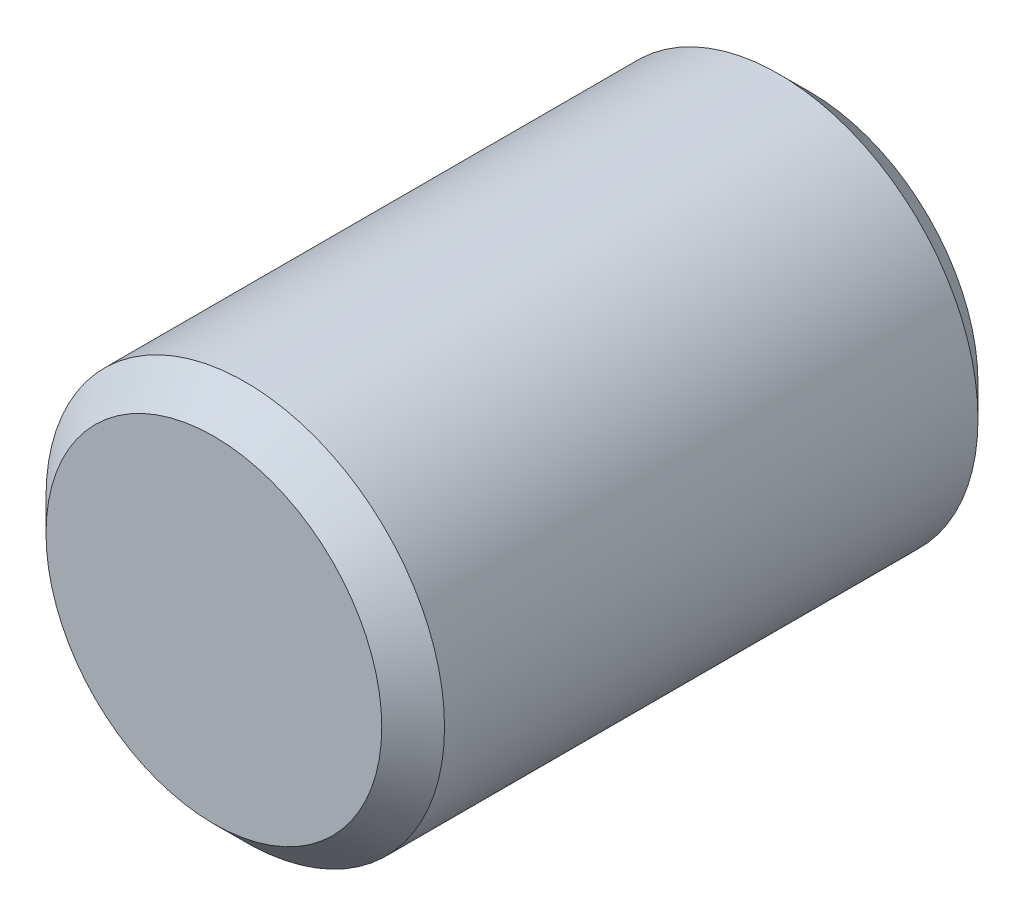
ISO-10303-21;
HEADER;
FILE_DESCRIPTION(('STEP AP214'),'2;1');
FILE_NAME('part.step','',(''),(''),'','','');
FILE_SCHEMA(('AUTOMOTIVE_DESIGN { 1 0 10303 214 1 1 1 1 }'));
ENDSEC;
DATA;
#1=APPLICATION_CONTEXT('core data for automotive mechanical design processes');
#2=APPLICATION_PROTOCOL_DEFINITION('international standard','automotive_design',2000,#1);
#3=PRODUCT_CONTEXT('',#1,'mechanical');
#4=PRODUCT('Part','Part','',(#3));
#5=PRODUCT_RELATED_PRODUCT_CATEGORY('part','',(#4));
#6=PRODUCT_DEFINITION_FORMATION('','',#4);
#7=PRODUCT_DEFINITION_CONTEXT('part definition',#1,'design');
#8=PRODUCT_DEFINITION('design','',#6,#7);
#9=PRODUCT_DEFINITION_SHAPE('','',#8);
#10=(LENGTH_UNIT() NAMED_UNIT(*) SI_UNIT(.MILLI.,.METRE.));
#11=(NAMED_UNIT(*) PLANE_ANGLE_UNIT() SI_UNIT($,.RADIAN.));
#12=(NAMED_UNIT(*) SI_UNIT($,.STERADIAN.) SOLID_ANGLE_UNIT());
#13=UNCERTAINTY_MEASURE_WITH_UNIT(LENGTH_MEASURE(1.E-05),#10,'distance_accuracy_value','');
#14=(GEOMETRIC_REPRESENTATION_CONTEXT(3) GLOBAL_UNCERTAINTY_ASSIGNED_CONTEXT((#13)) GLOBAL_UNIT_ASSIGNED_CONTEXT((#10,
#11,#12)) REPRESENTATION_CONTEXT('',''));
#15=CARTESIAN_POINT('',(0.,0.,0.));
#16=DIRECTION('',(0.,0.,1.));
#17=DIRECTION('',(1.,0.,0.));
#18=AXIS2_PLACEMENT_3D('',#15,#16,#17);
#19=CARTESIAN_POINT('',(0.,0.,-4.75));
#20=DIRECTION('',(0.,0.,1.));
#21=DIRECTION('',(1.,0.,0.));
#22=AXIS2_PLACEMENT_3D('',#19,#20,#21);
#23=CYLINDRICAL_SURFACE('',#22,3.175);
#24=CARTESIAN_POINT('',(0.,0.,-4.25));
#25=DIRECTION('',(0.,0.,1.));
#26=DIRECTION('',(1.,0.,0.));
#27=AXIS2_PLACEMENT_3D('',#24,#25,#26);
#28=CIRCLE('',#27,3.175);
#29=CARTESIAN_POINT('',(3.175,0.,-4.25));
#30=VERTEX_POINT('',#29);
#31=EDGE_CURVE('E41',#30,#30,#28,.T.);
#32=ORIENTED_EDGE('',*,*,#31,.T.);
#33=EDGE_LOOP('',(#32));
#34=FACE_BOUND('',#33,.T.);
#35=CARTESIAN_POINT('',(0.,0.,4.25));
#36=DIRECTION('',(0.,0.,1.));
#37=DIRECTION('',(1.,0.,0.));
#38=AXIS2_PLACEMENT_3D('',#35,#36,#37);
#39=CIRCLE('',#38,3.175);
#40=CARTESIAN_POINT('',(3.175,0.,4.25));
#41=VERTEX_POINT('',#40);
#42=EDGE_CURVE('E45',#41,#41,#39,.F.);
#43=ORIENTED_EDGE('',*,*,#42,.T.);
#44=EDGE_LOOP('',(#43));
#45=FACE_BOUND('',#44,.T.);
#46=ADVANCED_FACE('F30',(#34,#45),#23,.T.);
#47=CARTESIAN_POINT('',(0.,0.,-4.75));
#48=DIRECTION('',(0.,0.,1.));
#49=DIRECTION('',(1.,0.,0.));
#50=AXIS2_PLACEMENT_3D('',#47,#48,#49);
#51=PLANE('',#50);
#52=CARTESIAN_POINT('',(0.,0.,-4.75));
#53=DIRECTION('',(0.,0.,1.));
#54=DIRECTION('',(1.,0.,0.));
#55=AXIS2_PLACEMENT_3D('',#52,#53,#54);
#56=CIRCLE('',#55,2.675);
#57=CARTESIAN_POINT('',(2.675,0.,-4.75));
#58=VERTEX_POINT('',#57);
#59=EDGE_CURVE('E37',#58,#58,#56,.F.);
#60=ORIENTED_EDGE('',*,*,#59,.T.);
#61=EDGE_LOOP('',(#60));
#62=FACE_BOUND('',#61,.T.);
#63=ADVANCED_FACE('F61',(#62),#51,.F.);
#64=CARTESIAN_POINT('',(0.,0.,4.75));
#65=DIRECTION('',(0.,0.,1.));
#66=DIRECTION('',(1.,0.,0.));
#67=AXIS2_PLACEMENT_3D('',#64,#65,#66);
#68=PLANE('',#67);
#69=CARTESIAN_POINT('',(0.,0.,4.75));
#70=DIRECTION('',(0.,0.,1.));
#71=DIRECTION('',(1.,0.,0.));
#72=AXIS2_PLACEMENT_3D('',#69,#70,#71);
#73=CIRCLE('',#72,2.675);
#74=CARTESIAN_POINT('',(2.675,0.,4.75));
#75=VERTEX_POINT('',#74);
#76=EDGE_CURVE('E10',#75,#75,#73,.T.);
#77=ORIENTED_EDGE('',*,*,#76,.T.);
#78=EDGE_LOOP('',(#77));
#79=FACE_BOUND('',#78,.T.);
#80=ADVANCED_FACE('F58',(#79),#68,.T.);
#81=CARTESIAN_POINT('',(0.,0.,-4.25));
#82=DIRECTION('',(0.,0.,1.));
#83=DIRECTION('',(1.,0.,0.));
#84=AXIS2_PLACEMENT_3D('',#81,#82,#83);
#85=CONICAL_SURFACE('',#84,3.175,0.78539816339745);
#86=ORIENTED_EDGE('',*,*,#59,.F.);
#87=EDGE_LOOP('',(#86));
#88=FACE_BOUND('',#87,.T.);
#89=ORIENTED_EDGE('',*,*,#31,.F.);
#90=EDGE_LOOP('',(#89));
#91=FACE_BOUND('',#90,.T.);
#92=ADVANCED_FACE('F54',(#88,#91),#85,.T.);
#93=CARTESIAN_POINT('',(0.,0.,4.75));
#94=DIRECTION('',(0.,0.,-1.));
#95=DIRECTION('',(-1.,0.,0.));
#96=AXIS2_PLACEMENT_3D('',#93,#94,#95);
#97=CONICAL_SURFACE('',#96,2.675,0.785398163397446);
#98=ORIENTED_EDGE('',*,*,#42,.F.);
#99=EDGE_LOOP('',(#98));
#100=FACE_BOUND('',#99,.T.);
#101=ORIENTED_EDGE('',*,*,#76,.F.);
#102=EDGE_LOOP('',(#101));
#103=FACE_BOUND('',#102,.T.);
#104=ADVANCED_FACE('F32',(#100,#103),#97,.T.);
#105=CLOSED_SHELL('',(#46,#63,#80,#92,#104));
#106=MANIFOLD_SOLID_BREP('B2',#105);
#107=ADVANCED_BREP_SHAPE_REPRESENTATION('',(#18,#106),#14);
#108=SHAPE_DEFINITION_REPRESENTATION(#9,#107);
ENDSEC;
END-ISO-10303-21;
